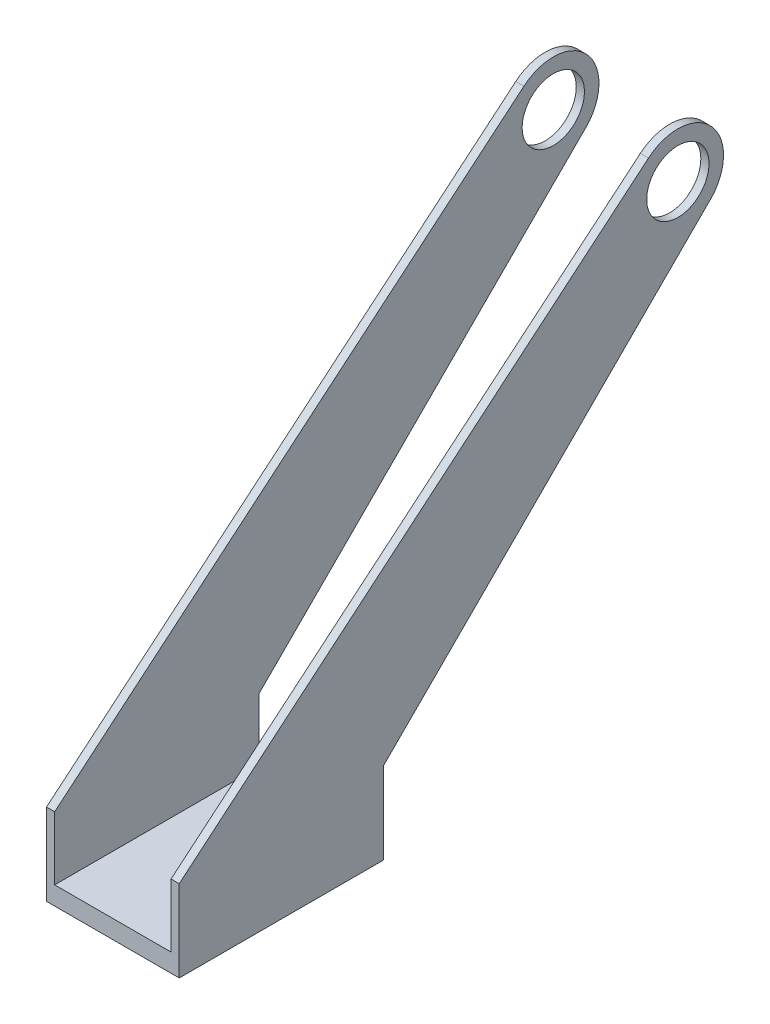
ISO-10303-21;
HEADER;
FILE_DESCRIPTION(('STEP AP214'),'2;1');
FILE_NAME('part.step','',(''),(''),'','','');
FILE_SCHEMA(('AUTOMOTIVE_DESIGN { 1 0 10303 214 1 1 1 1 }'));
ENDSEC;
DATA;
#1=APPLICATION_CONTEXT('core data for automotive mechanical design processes');
#2=APPLICATION_PROTOCOL_DEFINITION('international standard','automotive_design',2000,#1);
#3=PRODUCT_CONTEXT('',#1,'mechanical');
#4=PRODUCT('Part','Part','',(#3));
#5=PRODUCT_RELATED_PRODUCT_CATEGORY('part','',(#4));
#6=PRODUCT_DEFINITION_FORMATION('','',#4);
#7=PRODUCT_DEFINITION_CONTEXT('part definition',#1,'design');
#8=PRODUCT_DEFINITION('design','',#6,#7);
#9=PRODUCT_DEFINITION_SHAPE('','',#8);
#10=(LENGTH_UNIT() NAMED_UNIT(*) SI_UNIT(.MILLI.,.METRE.));
#11=(NAMED_UNIT(*) PLANE_ANGLE_UNIT() SI_UNIT($,.RADIAN.));
#12=(NAMED_UNIT(*) SI_UNIT($,.STERADIAN.) SOLID_ANGLE_UNIT());
#13=UNCERTAINTY_MEASURE_WITH_UNIT(LENGTH_MEASURE(1.E-05),#10,'distance_accuracy_value','');
#14=(GEOMETRIC_REPRESENTATION_CONTEXT(3) GLOBAL_UNCERTAINTY_ASSIGNED_CONTEXT((#13)) GLOBAL_UNIT_ASSIGNED_CONTEXT((#10,
#11,#12)) REPRESENTATION_CONTEXT('',''));
#15=CARTESIAN_POINT('',(0.,0.,0.));
#16=DIRECTION('',(0.,0.,1.));
#17=DIRECTION('',(1.,0.,0.));
#18=AXIS2_PLACEMENT_3D('',#15,#16,#17);
#19=CARTESIAN_POINT('',(70.,175.563444624445,-205.56353149725));
#20=DIRECTION('',(0.,0.707106781186554,0.707106781186541));
#21=DIRECTION('',(0.,-0.707106781186541,0.707106781186554));
#22=AXIS2_PLACEMENT_3D('',#19,#20,#21);
#23=PLANE('',#22);
#24=DIRECTION('',(0.,0.707106781186544,-0.707106781186551));
#25=VECTOR('',#24,1.);
#26=CARTESIAN_POINT('',(67.5,19.9999527634058,-50.0000396362089));
#27=LINE('',#26,#25);
#28=CARTESIAN_POINT('',(67.5,19.9999527634058,-50.0000396362089));
#29=VERTEX_POINT('',#28);
#30=CARTESIAN_POINT('',(67.5,178.567863852052,-208.567950724857));
#31=VERTEX_POINT('',#30);
#32=EDGE_CURVE('E127',#29,#31,#27,.T.);
#33=ORIENTED_EDGE('',*,*,#32,.F.);
#34=DIRECTION('',(-1.,0.,0.));
#35=VECTOR('',#34,1.);
#36=CARTESIAN_POINT('',(70.,19.9999527634058,-50.0000396362089));
#37=LINE('',#36,#35);
#38=CARTESIAN_POINT('',(63.5,19.9999527634071,-50.0000396362089));
#39=VERTEX_POINT('',#38);
#40=EDGE_CURVE('E157',#29,#39,#37,.T.);
#41=ORIENTED_EDGE('',*,*,#40,.T.);
#42=DIRECTION('',(0.,0.707106781186541,-0.707106781186554));
#43=VECTOR('',#42,1.);
#44=CARTESIAN_POINT('',(63.5,175.563444624445,-205.56353149725));
#45=LINE('',#44,#43);
#46=CARTESIAN_POINT('',(63.5,178.567863852052,-208.567950724857));
#47=VERTEX_POINT('',#46);
#48=EDGE_CURVE('E208',#39,#47,#45,.T.);
#49=ORIENTED_EDGE('',*,*,#48,.T.);
#50=DIRECTION('',(-1.,0.,0.));
#51=VECTOR('',#50,1.);
#52=CARTESIAN_POINT('',(70.,178.567863852052,-208.567950724857));
#53=LINE('',#52,#51);
#54=EDGE_CURVE('E150',#31,#47,#53,.T.);
#55=ORIENTED_EDGE('',*,*,#54,.F.);
#56=EDGE_LOOP('',(#33,#41,#49,#55));
#57=FACE_BOUND('',#56,.T.);
#58=ADVANCED_FACE('F33',(#57),#23,.F.);
#59=CARTESIAN_POINT('',(70.,195.702049760709,-194.19066164838));
#60=DIRECTION('',(-1.,0.,0.));
#61=DIRECTION('',(0.,0.,1.));
#62=AXIS2_PLACEMENT_3D('',#59,#60,#61);
#63=CYLINDRICAL_SURFACE('',#62,22.3670911819352);
#64=CARTESIAN_POINT('',(67.5,195.702049760709,-194.19066164838));
#65=DIRECTION('',(1.,0.,0.));
#66=DIRECTION('',(0.,0.,-1.));
#67=AXIS2_PLACEMENT_3D('',#64,#65,#66);
#68=CIRCLE('',#67,22.3670911819352);
#69=CARTESIAN_POINT('',(67.5,212.836235669366,-179.813372571903));
#70=VERTEX_POINT('',#69);
#71=EDGE_CURVE('E121',#31,#70,#68,.T.);
#72=ORIENTED_EDGE('',*,*,#71,.F.);
#73=ORIENTED_EDGE('',*,*,#54,.T.);
#74=CARTESIAN_POINT('',(63.5,195.702049760709,-194.19066164838));
#75=DIRECTION('',(1.,0.,0.));
#76=DIRECTION('',(0.,0.,-1.));
#77=AXIS2_PLACEMENT_3D('',#74,#75,#76);
#78=CIRCLE('',#77,22.3670911819352);
#79=CARTESIAN_POINT('',(63.5,212.836235669366,-179.813372571903));
#80=VERTEX_POINT('',#79);
#81=EDGE_CURVE('E144',#47,#80,#78,.T.);
#82=ORIENTED_EDGE('',*,*,#81,.T.);
#83=DIRECTION('',(-1.,0.,0.));
#84=VECTOR('',#83,1.);
#85=CARTESIAN_POINT('',(70.,212.836235669366,-179.813372571903));
#86=LINE('',#85,#84);
#87=EDGE_CURVE('E137',#70,#80,#86,.T.);
#88=ORIENTED_EDGE('',*,*,#87,.F.);
#89=EDGE_LOOP('',(#72,#73,#82,#88));
#90=FACE_BOUND('',#89,.T.);
#91=ADVANCED_FACE('F142',(#90),#63,.T.);
#92=CARTESIAN_POINT('',(70.,19.9999527634058,49.9999603637912));
#93=DIRECTION('',(0.,-0.766044443118982,-0.642787609686535));
#94=DIRECTION('',(0.,0.642787609686535,-0.766044443118982));
#95=AXIS2_PLACEMENT_3D('',#92,#93,#94);
#96=PLANE('',#95);
#97=DIRECTION('',(0.,-0.642787609686535,0.766044443118982));
#98=VECTOR('',#97,1.);
#99=CARTESIAN_POINT('',(67.5,212.836235669366,-179.813372571903));
#100=LINE('',#99,#98);
#101=CARTESIAN_POINT('',(67.5,19.9999527634058,49.9999603637912));
#102=VERTEX_POINT('',#101);
#103=EDGE_CURVE('E124',#70,#102,#100,.T.);
#104=ORIENTED_EDGE('',*,*,#103,.F.);
#105=ORIENTED_EDGE('',*,*,#87,.T.);
#106=DIRECTION('',(0.,-0.642787609686535,0.766044443118982));
#107=VECTOR('',#106,1.);
#108=CARTESIAN_POINT('',(63.5,19.9999527634058,49.9999603637912));
#109=LINE('',#108,#107);
#110=CARTESIAN_POINT('',(63.5,19.9999527634058,49.9999603637912));
#111=VERTEX_POINT('',#110);
#112=EDGE_CURVE('E170',#80,#111,#109,.T.);
#113=ORIENTED_EDGE('',*,*,#112,.T.);
#114=DIRECTION('',(-1.,0.,0.));
#115=VECTOR('',#114,1.);
#116=CARTESIAN_POINT('',(70.,19.9999527634058,49.9999603637912));
#117=LINE('',#116,#115);
#118=EDGE_CURVE('E139',#102,#111,#117,.T.);
#119=ORIENTED_EDGE('',*,*,#118,.F.);
#120=EDGE_LOOP('',(#104,#105,#113,#119));
#121=FACE_BOUND('',#120,.T.);
#122=ADVANCED_FACE('F135',(#121),#96,.F.);
#123=CARTESIAN_POINT('',(70.,195.702049760709,-194.19066164838));
#124=DIRECTION('',(-1.,0.,0.));
#125=DIRECTION('',(0.,0.,1.));
#126=AXIS2_PLACEMENT_3D('',#123,#124,#125);
#127=CYLINDRICAL_SURFACE('',#126,15.25);
#128=CARTESIAN_POINT('',(63.5,195.702049760709,-194.19066164838));
#129=DIRECTION('',(1.,0.,0.));
#130=DIRECTION('',(0.,0.,-1.));
#131=AXIS2_PLACEMENT_3D('',#128,#129,#130);
#132=CIRCLE('',#131,15.25);
#133=CARTESIAN_POINT('',(63.5,195.702049760709,-209.44066164838));
#134=VERTEX_POINT('',#133);
#135=EDGE_CURVE('E168',#134,#134,#132,.T.);
#136=ORIENTED_EDGE('',*,*,#135,.F.);
#137=EDGE_LOOP('',(#136));
#138=FACE_BOUND('',#137,.T.);
#139=CARTESIAN_POINT('',(67.5,195.702049760709,-194.19066164838));
#140=DIRECTION('',(1.,0.,0.));
#141=DIRECTION('',(0.,0.,-1.));
#142=AXIS2_PLACEMENT_3D('',#139,#140,#141);
#143=CIRCLE('',#142,15.25);
#144=CARTESIAN_POINT('',(67.5,195.702049760709,-209.44066164838));
#145=VERTEX_POINT('',#144);
#146=EDGE_CURVE('E131',#145,#145,#143,.T.);
#147=ORIENTED_EDGE('',*,*,#146,.T.);
#148=EDGE_LOOP('',(#147));
#149=FACE_BOUND('',#148,.T.);
#150=ADVANCED_FACE('F252',(#138,#149),#127,.F.);
#151=CARTESIAN_POINT('',(70.,19.9999527634058,49.9999603637912));
#152=DIRECTION('',(0.,0.,-1.));
#153=DIRECTION('',(-1.,0.,0.));
#154=AXIS2_PLACEMENT_3D('',#151,#152,#153);
#155=PLANE('',#154);
#156=DIRECTION('',(0.,-1.,0.));
#157=VECTOR('',#156,1.);
#158=CARTESIAN_POINT('',(67.5,19.9999527634058,49.9999603637912));
#159=LINE('',#158,#157);
#160=CARTESIAN_POINT('',(67.5,-20.0000472365942,49.9999603637912));
#161=VERTEX_POINT('',#160);
#162=EDGE_CURVE('E140',#102,#161,#159,.T.);
#163=ORIENTED_EDGE('',*,*,#162,.F.);
#164=ORIENTED_EDGE('',*,*,#118,.T.);
#165=DIRECTION('',(0.,1.,0.));
#166=VECTOR('',#165,1.);
#167=CARTESIAN_POINT('',(63.5,-11.0000472365942,49.9999603637912));
#168=LINE('',#167,#166);
#169=CARTESIAN_POINT('',(63.5,-11.0000472365942,49.9999603637912));
#170=VERTEX_POINT('',#169);
#171=EDGE_CURVE('E216',#170,#111,#168,.T.);
#172=ORIENTED_EDGE('',*,*,#171,.F.);
#173=DIRECTION('',(1.,0.,0.));
#174=VECTOR('',#173,1.);
#175=CARTESIAN_POINT('',(6.5,-11.0000472365942,49.9999603637912));
#176=LINE('',#175,#174);
#177=CARTESIAN_POINT('',(6.5,-11.0000472365942,49.9999603637912));
#178=VERTEX_POINT('',#177);
#179=EDGE_CURVE('E194',#178,#170,#176,.T.);
#180=ORIENTED_EDGE('',*,*,#179,.F.);
#181=DIRECTION('',(0.,-1.,0.));
#182=VECTOR('',#181,1.);
#183=CARTESIAN_POINT('',(6.5,-11.0000472365942,49.9999603637912));
#184=LINE('',#183,#182);
#185=CARTESIAN_POINT('',(6.5,19.9999527634058,49.9999603637912));
#186=VERTEX_POINT('',#185);
#187=EDGE_CURVE('E192',#186,#178,#184,.T.);
#188=ORIENTED_EDGE('',*,*,#187,.F.);
#189=CARTESIAN_POINT('',(2.5,19.9999527634058,49.9999603637912));
#190=VERTEX_POINT('',#189);
#191=EDGE_CURVE('E210',#186,#190,#117,.T.);
#192=ORIENTED_EDGE('',*,*,#191,.T.);
#193=DIRECTION('',(0.,-1.,0.));
#194=VECTOR('',#193,1.);
#195=CARTESIAN_POINT('',(2.5,19.9999527634058,49.9999603637912));
#196=LINE('',#195,#194);
#197=CARTESIAN_POINT('',(2.5,-20.0000472365942,49.9999603637912));
#198=VERTEX_POINT('',#197);
#199=EDGE_CURVE('E56',#190,#198,#196,.T.);
#200=ORIENTED_EDGE('',*,*,#199,.T.);
#201=DIRECTION('',(-1.,0.,0.));
#202=VECTOR('',#201,1.);
#203=CARTESIAN_POINT('',(70.,-20.0000472365942,49.9999603637912));
#204=LINE('',#203,#202);
#205=EDGE_CURVE('E161',#161,#198,#204,.T.);
#206=ORIENTED_EDGE('',*,*,#205,.F.);
#207=EDGE_LOOP('',(#163,#164,#172,#180,#188,#192,#200,#206));
#208=FACE_BOUND('',#207,.T.);
#209=ADVANCED_FACE('F35',(#208),#155,.F.);
#210=CARTESIAN_POINT('',(70.,-20.0000472365942,-50.0000396362088));
#211=DIRECTION('',(0.,1.,0.));
#212=DIRECTION('',(0.,0.,1.));
#213=AXIS2_PLACEMENT_3D('',#210,#211,#212);
#214=PLANE('',#213);
#215=CARTESIAN_POINT('',(35.,-20.0000472365942,-3.96362088560254E-05));
#216=DIRECTION('',(0.,1.,0.));
#217=DIRECTION('',(0.,0.,1.));
#218=AXIS2_PLACEMENT_3D('',#215,#216,#217);
#219=CIRCLE('',#218,10.7);
#220=CARTESIAN_POINT('',(35.,-20.0000472365942,10.6999603637911));
#221=VERTEX_POINT('',#220);
#222=EDGE_CURVE('E11',#221,#221,#219,.F.);
#223=ORIENTED_EDGE('',*,*,#222,.F.);
#224=EDGE_LOOP('',(#223));
#225=FACE_BOUND('',#224,.T.);
#226=DIRECTION('',(0.,0.,-1.));
#227=VECTOR('',#226,1.);
#228=CARTESIAN_POINT('',(67.5,-20.0000472365942,49.9999603637912));
#229=LINE('',#228,#227);
#230=CARTESIAN_POINT('',(67.5,-20.0000472365942,-50.0000396362088));
#231=VERTEX_POINT('',#230);
#232=EDGE_CURVE('E48',#161,#231,#229,.T.);
#233=ORIENTED_EDGE('',*,*,#232,.F.);
#234=ORIENTED_EDGE('',*,*,#205,.T.);
#235=DIRECTION('',(0.,0.,-1.));
#236=VECTOR('',#235,1.);
#237=CARTESIAN_POINT('',(2.5,-20.0000472365942,-50.0000396362088));
#238=LINE('',#237,#236);
#239=CARTESIAN_POINT('',(2.5,-20.0000472365942,-50.0000396362088));
#240=VERTEX_POINT('',#239);
#241=EDGE_CURVE('E237',#198,#240,#238,.T.);
#242=ORIENTED_EDGE('',*,*,#241,.T.);
#243=DIRECTION('',(-1.,0.,0.));
#244=VECTOR('',#243,1.);
#245=CARTESIAN_POINT('',(70.,-20.0000472365942,-50.0000396362088));
#246=LINE('',#245,#244);
#247=EDGE_CURVE('E159',#231,#240,#246,.T.);
#248=ORIENTED_EDGE('',*,*,#247,.F.);
#249=EDGE_LOOP('',(#233,#234,#242,#248));
#250=FACE_BOUND('',#249,.T.);
#251=ADVANCED_FACE('F282',(#225,#250),#214,.F.);
#252=CARTESIAN_POINT('',(70.,19.9999527634058,-50.0000396362089));
#253=DIRECTION('',(0.,0.,1.));
#254=DIRECTION('',(0.,-1.,0.));
#255=AXIS2_PLACEMENT_3D('',#252,#253,#254);
#256=PLANE('',#255);
#257=DIRECTION('',(0.,1.,0.));
#258=VECTOR('',#257,1.);
#259=CARTESIAN_POINT('',(67.5,-20.0000472365942,-50.0000396362088));
#260=LINE('',#259,#258);
#261=EDGE_CURVE('E245',#231,#29,#260,.T.);
#262=ORIENTED_EDGE('',*,*,#261,.F.);
#263=ORIENTED_EDGE('',*,*,#247,.T.);
#264=DIRECTION('',(0.,1.,0.));
#265=VECTOR('',#264,1.);
#266=CARTESIAN_POINT('',(2.5,19.9999527634058,-50.0000396362089));
#267=LINE('',#266,#265);
#268=CARTESIAN_POINT('',(2.5,19.9999527634058,-50.0000396362089));
#269=VERTEX_POINT('',#268);
#270=EDGE_CURVE('E234',#240,#269,#267,.T.);
#271=ORIENTED_EDGE('',*,*,#270,.T.);
#272=CARTESIAN_POINT('',(6.50000000000001,19.9999527634071,-50.0000396362089));
#273=VERTEX_POINT('',#272);
#274=EDGE_CURVE('E156',#273,#269,#37,.T.);
#275=ORIENTED_EDGE('',*,*,#274,.F.);
#276=DIRECTION('',(0.,-1.,0.));
#277=VECTOR('',#276,1.);
#278=CARTESIAN_POINT('',(6.50000000000001,19.9999527634058,-50.0000396362089));
#279=LINE('',#278,#277);
#280=CARTESIAN_POINT('',(6.5,-11.0000472365942,-50.0000396362088));
#281=VERTEX_POINT('',#280);
#282=EDGE_CURVE('E171',#273,#281,#279,.T.);
#283=ORIENTED_EDGE('',*,*,#282,.T.);
#284=DIRECTION('',(1.,0.,0.));
#285=VECTOR('',#284,1.);
#286=CARTESIAN_POINT('',(70.,-11.0000472365942,-50.0000396362088));
#287=LINE('',#286,#285);
#288=CARTESIAN_POINT('',(63.5,-11.0000472365942,-50.0000396362088));
#289=VERTEX_POINT('',#288);
#290=EDGE_CURVE('E41',#281,#289,#287,.T.);
#291=ORIENTED_EDGE('',*,*,#290,.T.);
#292=DIRECTION('',(0.,1.,0.));
#293=VECTOR('',#292,1.);
#294=CARTESIAN_POINT('',(63.5,19.9999527634058,-50.0000396362089));
#295=LINE('',#294,#293);
#296=EDGE_CURVE('E178',#289,#39,#295,.T.);
#297=ORIENTED_EDGE('',*,*,#296,.T.);
#298=ORIENTED_EDGE('',*,*,#40,.F.);
#299=EDGE_LOOP('',(#262,#263,#271,#275,#283,#291,#297,#298));
#300=FACE_BOUND('',#299,.T.);
#301=ADVANCED_FACE('F176',(#300),#256,.F.);
#302=ORIENTED_EDGE('',*,*,#274,.T.);
#303=DIRECTION('',(0.,0.707106781186544,-0.707106781186551));
#304=VECTOR('',#303,1.);
#305=CARTESIAN_POINT('',(2.5,19.9999527634058,-50.0000396362089));
#306=LINE('',#305,#304);
#307=CARTESIAN_POINT('',(2.5,178.567863852052,-208.567950724857));
#308=VERTEX_POINT('',#307);
#309=EDGE_CURVE('E231',#269,#308,#306,.T.);
#310=ORIENTED_EDGE('',*,*,#309,.T.);
#311=CARTESIAN_POINT('',(6.50000000000001,178.567863852052,-208.567950724857));
#312=VERTEX_POINT('',#311);
#313=EDGE_CURVE('E146',#312,#308,#53,.T.);
#314=ORIENTED_EDGE('',*,*,#313,.F.);
#315=DIRECTION('',(0.,-0.707106781186541,0.707106781186554));
#316=VECTOR('',#315,1.);
#317=CARTESIAN_POINT('',(6.50000000000001,175.563444624445,-205.56353149725));
#318=LINE('',#317,#316);
#319=EDGE_CURVE('E203',#312,#273,#318,.T.);
#320=ORIENTED_EDGE('',*,*,#319,.T.);
#321=EDGE_LOOP('',(#302,#310,#314,#320));
#322=FACE_BOUND('',#321,.T.);
#323=ADVANCED_FACE('F265',(#322),#23,.F.);
#324=ORIENTED_EDGE('',*,*,#313,.T.);
#325=CARTESIAN_POINT('',(2.5,195.702049760709,-194.19066164838));
#326=DIRECTION('',(1.,0.,0.));
#327=DIRECTION('',(0.,0.,-1.));
#328=AXIS2_PLACEMENT_3D('',#325,#326,#327);
#329=CIRCLE('',#328,22.3670911819352);
#330=CARTESIAN_POINT('',(2.5,212.836235669366,-179.813372571903));
#331=VERTEX_POINT('',#330);
#332=EDGE_CURVE('E228',#308,#331,#329,.T.);
#333=ORIENTED_EDGE('',*,*,#332,.T.);
#334=CARTESIAN_POINT('',(6.50000000000001,212.836235669366,-179.813372571903));
#335=VERTEX_POINT('',#334);
#336=EDGE_CURVE('E147',#335,#331,#86,.T.);
#337=ORIENTED_EDGE('',*,*,#336,.F.);
#338=CARTESIAN_POINT('',(6.50000000000001,195.702049760709,-194.19066164838));
#339=DIRECTION('',(-1.,0.,0.));
#340=DIRECTION('',(0.,0.,1.));
#341=AXIS2_PLACEMENT_3D('',#338,#339,#340);
#342=CIRCLE('',#341,22.3670911819352);
#343=EDGE_CURVE('E201',#335,#312,#342,.T.);
#344=ORIENTED_EDGE('',*,*,#343,.T.);
#345=EDGE_LOOP('',(#324,#333,#337,#344));
#346=FACE_BOUND('',#345,.T.);
#347=ADVANCED_FACE('F271',(#346),#63,.T.);
#348=ORIENTED_EDGE('',*,*,#336,.T.);
#349=DIRECTION('',(0.,-0.642787609686535,0.766044443118982));
#350=VECTOR('',#349,1.);
#351=CARTESIAN_POINT('',(2.5,19.9999527634058,49.9999603637912));
#352=LINE('',#351,#350);
#353=EDGE_CURVE('E224',#331,#190,#352,.T.);
#354=ORIENTED_EDGE('',*,*,#353,.T.);
#355=ORIENTED_EDGE('',*,*,#191,.F.);
#356=DIRECTION('',(0.,0.642787609686535,-0.766044443118982));
#357=VECTOR('',#356,1.);
#358=CARTESIAN_POINT('',(6.50000000000001,19.9999527634058,49.9999603637912));
#359=LINE('',#358,#357);
#360=EDGE_CURVE('E166',#186,#335,#359,.T.);
#361=ORIENTED_EDGE('',*,*,#360,.T.);
#362=EDGE_LOOP('',(#348,#354,#355,#361));
#363=FACE_BOUND('',#362,.T.);
#364=ADVANCED_FACE('F279',(#363),#96,.F.);
#365=CARTESIAN_POINT('',(2.5,195.702049760709,-194.19066164838));
#366=DIRECTION('',(1.,0.,0.));
#367=DIRECTION('',(0.,0.,-1.));
#368=AXIS2_PLACEMENT_3D('',#365,#366,#367);
#369=CIRCLE('',#368,15.25);
#370=CARTESIAN_POINT('',(2.5,195.702049760709,-209.44066164838));
#371=VERTEX_POINT('',#370);
#372=EDGE_CURVE('E241',#371,#371,#369,.T.);
#373=ORIENTED_EDGE('',*,*,#372,.F.);
#374=EDGE_LOOP('',(#373));
#375=FACE_BOUND('',#374,.T.);
#376=CARTESIAN_POINT('',(6.50000000000001,195.702049760709,-194.19066164838));
#377=DIRECTION('',(-1.,0.,0.));
#378=DIRECTION('',(0.,0.,1.));
#379=AXIS2_PLACEMENT_3D('',#376,#377,#378);
#380=CIRCLE('',#379,15.25);
#381=CARTESIAN_POINT('',(6.50000000000001,195.702049760709,-178.94066164838));
#382=VERTEX_POINT('',#381);
#383=EDGE_CURVE('E163',#382,#382,#380,.T.);
#384=ORIENTED_EDGE('',*,*,#383,.F.);
#385=EDGE_LOOP('',(#384));
#386=FACE_BOUND('',#385,.T.);
#387=ADVANCED_FACE('F311',(#375,#386),#127,.F.);
#388=CARTESIAN_POINT('',(6.5,-11.0000472365942,-216.557752830315));
#389=DIRECTION('',(0.,-1.,0.));
#390=DIRECTION('',(0.,0.,-1.));
#391=AXIS2_PLACEMENT_3D('',#388,#389,#390);
#392=PLANE('',#391);
#393=DIRECTION('',(0.,0.,1.));
#394=VECTOR('',#393,1.);
#395=CARTESIAN_POINT('',(6.5,-11.0000472365942,-216.557752830315));
#396=LINE('',#395,#394);
#397=EDGE_CURVE('E185',#281,#178,#396,.T.);
#398=ORIENTED_EDGE('',*,*,#397,.T.);
#399=ORIENTED_EDGE('',*,*,#179,.T.);
#400=DIRECTION('',(0.,0.,1.));
#401=VECTOR('',#400,1.);
#402=CARTESIAN_POINT('',(63.5,-11.0000472365942,-216.557752830315));
#403=LINE('',#402,#401);
#404=EDGE_CURVE('E167',#289,#170,#403,.T.);
#405=ORIENTED_EDGE('',*,*,#404,.F.);
#406=ORIENTED_EDGE('',*,*,#290,.F.);
#407=EDGE_LOOP('',(#398,#399,#405,#406));
#408=FACE_BOUND('',#407,.T.);
#409=ADVANCED_FACE('F183',(#408),#392,.F.);
#410=CARTESIAN_POINT('',(63.5,-11.0000472365942,-216.557752830315));
#411=DIRECTION('',(1.,0.,0.));
#412=DIRECTION('',(0.,0.,-1.));
#413=AXIS2_PLACEMENT_3D('',#410,#411,#412);
#414=PLANE('',#413);
#415=ORIENTED_EDGE('',*,*,#135,.T.);
#416=EDGE_LOOP('',(#415));
#417=FACE_BOUND('',#416,.T.);
#418=ORIENTED_EDGE('',*,*,#404,.T.);
#419=ORIENTED_EDGE('',*,*,#171,.T.);
#420=ORIENTED_EDGE('',*,*,#112,.F.);
#421=ORIENTED_EDGE('',*,*,#81,.F.);
#422=ORIENTED_EDGE('',*,*,#48,.F.);
#423=ORIENTED_EDGE('',*,*,#296,.F.);
#424=EDGE_LOOP('',(#418,#419,#420,#421,#422,#423));
#425=FACE_BOUND('',#424,.T.);
#426=ADVANCED_FACE('F219',(#417,#425),#414,.F.);
#427=CARTESIAN_POINT('',(6.5,-11.0000472365942,-216.557752830315));
#428=DIRECTION('',(-1.,0.,0.));
#429=DIRECTION('',(0.,0.,1.));
#430=AXIS2_PLACEMENT_3D('',#427,#428,#429);
#431=PLANE('',#430);
#432=ORIENTED_EDGE('',*,*,#383,.T.);
#433=EDGE_LOOP('',(#432));
#434=FACE_BOUND('',#433,.T.);
#435=ORIENTED_EDGE('',*,*,#319,.F.);
#436=ORIENTED_EDGE('',*,*,#343,.F.);
#437=ORIENTED_EDGE('',*,*,#360,.F.);
#438=ORIENTED_EDGE('',*,*,#187,.T.);
#439=ORIENTED_EDGE('',*,*,#397,.F.);
#440=ORIENTED_EDGE('',*,*,#282,.F.);
#441=EDGE_LOOP('',(#435,#436,#437,#438,#439,#440));
#442=FACE_BOUND('',#441,.T.);
#443=ADVANCED_FACE('F189',(#434,#442),#431,.F.);
#444=CARTESIAN_POINT('',(35.,-35.0000472365942,-3.9636208855505E-05));
#445=DIRECTION('',(0.,1.,0.));
#446=DIRECTION('',(0.,0.,1.));
#447=AXIS2_PLACEMENT_3D('',#444,#445,#446);
#448=CYLINDRICAL_SURFACE('',#447,10.7);
#449=CARTESIAN_POINT('',(35.,-35.0000472365942,-3.9636208855505E-05));
#450=DIRECTION('',(0.,-1.,0.));
#451=DIRECTION('',(0.,0.,-1.));
#452=AXIS2_PLACEMENT_3D('',#449,#450,#451);
#453=CIRCLE('',#452,10.7);
#454=CARTESIAN_POINT('',(35.,-35.0000472365942,-10.7000396362089));
#455=VERTEX_POINT('',#454);
#456=EDGE_CURVE('E220',#455,#455,#453,.T.);
#457=ORIENTED_EDGE('',*,*,#456,.F.);
#458=EDGE_LOOP('',(#457));
#459=FACE_BOUND('',#458,.T.);
#460=ORIENTED_EDGE('',*,*,#222,.T.);
#461=EDGE_LOOP('',(#460));
#462=FACE_BOUND('',#461,.T.);
#463=ADVANCED_FACE('F296',(#459,#462),#448,.T.);
#464=CARTESIAN_POINT('',(35.,-35.0000472365942,-3.9636208855505E-05));
#465=DIRECTION('',(0.,-1.,0.));
#466=DIRECTION('',(0.,0.,-1.));
#467=AXIS2_PLACEMENT_3D('',#464,#465,#466);
#468=PLANE('',#467);
#469=ORIENTED_EDGE('',*,*,#456,.T.);
#470=EDGE_LOOP('',(#469));
#471=FACE_BOUND('',#470,.T.);
#472=ADVANCED_FACE('F260',(#471),#468,.T.);
#473=CARTESIAN_POINT('',(2.5,195.702049760709,-194.19066164838));
#474=DIRECTION('',(1.,0.,0.));
#475=DIRECTION('',(0.,0.,-1.));
#476=AXIS2_PLACEMENT_3D('',#473,#474,#475);
#477=PLANE('',#476);
#478=ORIENTED_EDGE('',*,*,#199,.F.);
#479=ORIENTED_EDGE('',*,*,#353,.F.);
#480=ORIENTED_EDGE('',*,*,#332,.F.);
#481=ORIENTED_EDGE('',*,*,#309,.F.);
#482=ORIENTED_EDGE('',*,*,#270,.F.);
#483=ORIENTED_EDGE('',*,*,#241,.F.);
#484=EDGE_LOOP('',(#478,#479,#480,#481,#482,#483));
#485=FACE_BOUND('',#484,.T.);
#486=ORIENTED_EDGE('',*,*,#372,.T.);
#487=EDGE_LOOP('',(#486));
#488=FACE_BOUND('',#487,.T.);
#489=ADVANCED_FACE('F255',(#485,#488),#477,.F.);
#490=CARTESIAN_POINT('',(67.5,195.702049760709,-194.19066164838));
#491=DIRECTION('',(1.,0.,0.));
#492=DIRECTION('',(0.,0.,-1.));
#493=AXIS2_PLACEMENT_3D('',#490,#491,#492);
#494=PLANE('',#493);
#495=ORIENTED_EDGE('',*,*,#146,.F.);
#496=EDGE_LOOP('',(#495));
#497=FACE_BOUND('',#496,.T.);
#498=ORIENTED_EDGE('',*,*,#71,.T.);
#499=ORIENTED_EDGE('',*,*,#103,.T.);
#500=ORIENTED_EDGE('',*,*,#162,.T.);
#501=ORIENTED_EDGE('',*,*,#232,.T.);
#502=ORIENTED_EDGE('',*,*,#261,.T.);
#503=ORIENTED_EDGE('',*,*,#32,.T.);
#504=EDGE_LOOP('',(#498,#499,#500,#501,#502,#503));
#505=FACE_BOUND('',#504,.T.);
#506=ADVANCED_FACE('F123',(#497,#505),#494,.T.);
#507=CLOSED_SHELL('',(#58,#91,#122,#150,#209,#251,#301,#323,#347,#364,#387,#409,#426,#443,#463,
#472,#489,#506));
#508=MANIFOLD_SOLID_BREP('B2',#507);
#509=ADVANCED_BREP_SHAPE_REPRESENTATION('',(#18,#508),#14);
#510=SHAPE_DEFINITION_REPRESENTATION(#9,#509);
ENDSEC;
END-ISO-10303-21;
